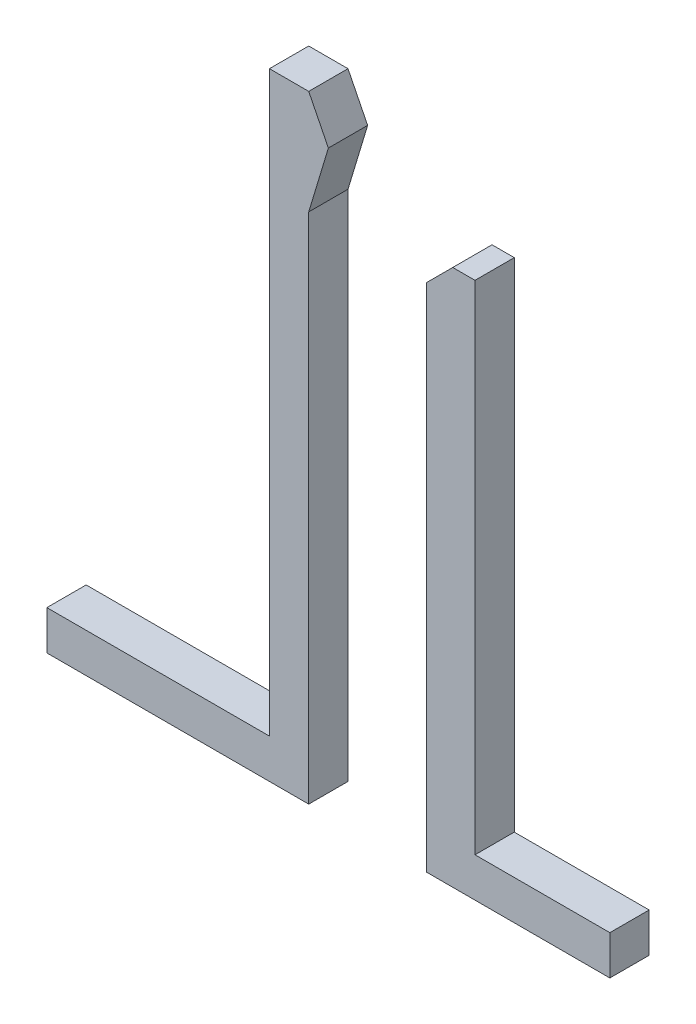
ISO-10303-21;
HEADER;
FILE_DESCRIPTION(('STEP AP214'),'2;1');
FILE_NAME('part.step','',(''),(''),'','','');
FILE_SCHEMA(('AUTOMOTIVE_DESIGN { 1 0 10303 214 1 1 1 1 }'));
ENDSEC;
DATA;
#1=APPLICATION_CONTEXT('core data for automotive mechanical design processes');
#2=APPLICATION_PROTOCOL_DEFINITION('international standard','automotive_design',2000,#1);
#3=PRODUCT_CONTEXT('',#1,'mechanical');
#4=PRODUCT('Part','Part','',(#3));
#5=PRODUCT_RELATED_PRODUCT_CATEGORY('part','',(#4));
#6=PRODUCT_DEFINITION_FORMATION('','',#4);
#7=PRODUCT_DEFINITION_CONTEXT('part definition',#1,'design');
#8=PRODUCT_DEFINITION('design','',#6,#7);
#9=PRODUCT_DEFINITION_SHAPE('','',#8);
#10=(LENGTH_UNIT() NAMED_UNIT(*) SI_UNIT(.MILLI.,.METRE.));
#11=(NAMED_UNIT(*) PLANE_ANGLE_UNIT() SI_UNIT($,.RADIAN.));
#12=(NAMED_UNIT(*) SI_UNIT($,.STERADIAN.) SOLID_ANGLE_UNIT());
#13=UNCERTAINTY_MEASURE_WITH_UNIT(LENGTH_MEASURE(1.E-05),#10,'distance_accuracy_value','');
#14=(GEOMETRIC_REPRESENTATION_CONTEXT(3) GLOBAL_UNCERTAINTY_ASSIGNED_CONTEXT((#13)) GLOBAL_UNIT_ASSIGNED_CONTEXT((#10,
#11,#12)) REPRESENTATION_CONTEXT('',''));
#15=CARTESIAN_POINT('',(0.,0.,0.));
#16=DIRECTION('',(0.,0.,1.));
#17=DIRECTION('',(1.,0.,0.));
#18=AXIS2_PLACEMENT_3D('',#15,#16,#17);
#19=CARTESIAN_POINT('',(1.95,0.2,0.3));
#20=DIRECTION('',(-1.,0.,0.));
#21=DIRECTION('',(0.,0.,1.));
#22=AXIS2_PLACEMENT_3D('',#19,#20,#21);
#23=PLANE('',#22);
#24=DIRECTION('',(0.,1.,0.));
#25=VECTOR('',#24,1.);
#26=CARTESIAN_POINT('',(1.95,0.2,0.));
#27=LINE('',#26,#25);
#28=CARTESIAN_POINT('',(1.95,-0.1,0.));
#29=VERTEX_POINT('',#28);
#30=CARTESIAN_POINT('',(1.95,0.2,0.));
#31=VERTEX_POINT('',#30);
#32=EDGE_CURVE('E135',#29,#31,#27,.T.);
#33=ORIENTED_EDGE('',*,*,#32,.T.);
#34=DIRECTION('',(0.,0.,-1.));
#35=VECTOR('',#34,1.);
#36=CARTESIAN_POINT('',(1.95,0.2,0.3));
#37=LINE('',#36,#35);
#38=CARTESIAN_POINT('',(1.95,0.2,0.3));
#39=VERTEX_POINT('',#38);
#40=EDGE_CURVE('E12',#39,#31,#37,.T.);
#41=ORIENTED_EDGE('',*,*,#40,.F.);
#42=DIRECTION('',(0.,1.,0.));
#43=VECTOR('',#42,1.);
#44=CARTESIAN_POINT('',(1.95,0.2,0.3));
#45=LINE('',#44,#43);
#46=CARTESIAN_POINT('',(1.95,-0.1,0.3));
#47=VERTEX_POINT('',#46);
#48=EDGE_CURVE('E147',#47,#39,#45,.T.);
#49=ORIENTED_EDGE('',*,*,#48,.F.);
#50=DIRECTION('',(0.,0.,-1.));
#51=VECTOR('',#50,1.);
#52=CARTESIAN_POINT('',(1.95,-0.1,0.3));
#53=LINE('',#52,#51);
#54=EDGE_CURVE('E131',#47,#29,#53,.T.);
#55=ORIENTED_EDGE('',*,*,#54,.T.);
#56=EDGE_LOOP('',(#33,#41,#49,#55));
#57=FACE_BOUND('',#56,.T.);
#58=ADVANCED_FACE('F45',(#57),#23,.F.);
#59=CARTESIAN_POINT('',(0.92,0.2,0.3));
#60=DIRECTION('',(0.,-1.,0.));
#61=DIRECTION('',(0.,0.,-1.));
#62=AXIS2_PLACEMENT_3D('',#59,#60,#61);
#63=PLANE('',#62);
#64=DIRECTION('',(-1.,0.,0.));
#65=VECTOR('',#64,1.);
#66=CARTESIAN_POINT('',(0.92,0.2,0.));
#67=LINE('',#66,#65);
#68=CARTESIAN_POINT('',(0.92,0.2,0.));
#69=VERTEX_POINT('',#68);
#70=EDGE_CURVE('E138',#31,#69,#67,.T.);
#71=ORIENTED_EDGE('',*,*,#70,.T.);
#72=DIRECTION('',(0.,0.,-1.));
#73=VECTOR('',#72,1.);
#74=CARTESIAN_POINT('',(0.92,0.2,0.3));
#75=LINE('',#74,#73);
#76=CARTESIAN_POINT('',(0.92,0.2,0.3));
#77=VERTEX_POINT('',#76);
#78=EDGE_CURVE('E53',#77,#69,#75,.T.);
#79=ORIENTED_EDGE('',*,*,#78,.F.);
#80=DIRECTION('',(-1.,0.,0.));
#81=VECTOR('',#80,1.);
#82=CARTESIAN_POINT('',(0.92,0.2,0.3));
#83=LINE('',#82,#81);
#84=EDGE_CURVE('E101',#39,#77,#83,.T.);
#85=ORIENTED_EDGE('',*,*,#84,.F.);
#86=ORIENTED_EDGE('',*,*,#40,.T.);
#87=EDGE_LOOP('',(#71,#79,#85,#86));
#88=FACE_BOUND('',#87,.T.);
#89=ADVANCED_FACE('F172',(#88),#63,.F.);
#90=CARTESIAN_POINT('',(0.92,4.,0.3));
#91=DIRECTION('',(-1.,0.,0.));
#92=DIRECTION('',(0.,-1.,0.));
#93=AXIS2_PLACEMENT_3D('',#90,#91,#92);
#94=PLANE('',#93);
#95=DIRECTION('',(0.,1.,0.));
#96=VECTOR('',#95,1.);
#97=CARTESIAN_POINT('',(0.92,4.,0.));
#98=LINE('',#97,#96);
#99=CARTESIAN_POINT('',(0.92,4.,0.));
#100=VERTEX_POINT('',#99);
#101=EDGE_CURVE('E140',#69,#100,#98,.T.);
#102=ORIENTED_EDGE('',*,*,#101,.T.);
#103=DIRECTION('',(0.,0.,-1.));
#104=VECTOR('',#103,1.);
#105=CARTESIAN_POINT('',(0.92,4.,0.3));
#106=LINE('',#105,#104);
#107=CARTESIAN_POINT('',(0.92,4.,0.3));
#108=VERTEX_POINT('',#107);
#109=EDGE_CURVE('E151',#108,#100,#106,.T.);
#110=ORIENTED_EDGE('',*,*,#109,.F.);
#111=DIRECTION('',(0.,1.,0.));
#112=VECTOR('',#111,1.);
#113=CARTESIAN_POINT('',(0.92,4.,0.3));
#114=LINE('',#113,#112);
#115=EDGE_CURVE('E159',#77,#108,#114,.T.);
#116=ORIENTED_EDGE('',*,*,#115,.F.);
#117=ORIENTED_EDGE('',*,*,#78,.T.);
#118=EDGE_LOOP('',(#102,#110,#116,#117));
#119=FACE_BOUND('',#118,.T.);
#120=ADVANCED_FACE('F157',(#119),#94,.F.);
#121=CARTESIAN_POINT('',(0.75,4.,0.3));
#122=DIRECTION('',(0.,-1.,0.));
#123=DIRECTION('',(0.,0.,-1.));
#124=AXIS2_PLACEMENT_3D('',#121,#122,#123);
#125=PLANE('',#124);
#126=DIRECTION('',(-1.,0.,0.));
#127=VECTOR('',#126,1.);
#128=CARTESIAN_POINT('',(0.75,4.,0.));
#129=LINE('',#128,#127);
#130=CARTESIAN_POINT('',(0.75,4.,0.));
#131=VERTEX_POINT('',#130);
#132=EDGE_CURVE('E142',#100,#131,#129,.T.);
#133=ORIENTED_EDGE('',*,*,#132,.T.);
#134=DIRECTION('',(0.,0.,-1.));
#135=VECTOR('',#134,1.);
#136=CARTESIAN_POINT('',(0.75,4.,0.3));
#137=LINE('',#136,#135);
#138=CARTESIAN_POINT('',(0.75,4.,0.3));
#139=VERTEX_POINT('',#138);
#140=EDGE_CURVE('E126',#139,#131,#137,.T.);
#141=ORIENTED_EDGE('',*,*,#140,.F.);
#142=DIRECTION('',(-1.,0.,0.));
#143=VECTOR('',#142,1.);
#144=CARTESIAN_POINT('',(0.75,4.,0.3));
#145=LINE('',#144,#143);
#146=EDGE_CURVE('E117',#108,#139,#145,.T.);
#147=ORIENTED_EDGE('',*,*,#146,.F.);
#148=ORIENTED_EDGE('',*,*,#109,.T.);
#149=EDGE_LOOP('',(#133,#141,#147,#148));
#150=FACE_BOUND('',#149,.T.);
#151=ADVANCED_FACE('F165',(#150),#125,.F.);
#152=CARTESIAN_POINT('',(0.55,3.8,0.3));
#153=DIRECTION('',(0.707106781186548,-0.707106781186547,0.));
#154=DIRECTION('',(0.707106781186547,0.707106781186548,0.));
#155=AXIS2_PLACEMENT_3D('',#152,#153,#154);
#156=PLANE('',#155);
#157=DIRECTION('',(-0.707106781186547,-0.707106781186548,0.));
#158=VECTOR('',#157,1.);
#159=CARTESIAN_POINT('',(0.55,3.8,0.));
#160=LINE('',#159,#158);
#161=CARTESIAN_POINT('',(0.55,3.8,0.));
#162=VERTEX_POINT('',#161);
#163=EDGE_CURVE('E125',#131,#162,#160,.T.);
#164=ORIENTED_EDGE('',*,*,#163,.T.);
#165=DIRECTION('',(0.,0.,-1.));
#166=VECTOR('',#165,1.);
#167=CARTESIAN_POINT('',(0.55,3.8,0.3));
#168=LINE('',#167,#166);
#169=CARTESIAN_POINT('',(0.55,3.8,0.3));
#170=VERTEX_POINT('',#169);
#171=EDGE_CURVE('E122',#170,#162,#168,.T.);
#172=ORIENTED_EDGE('',*,*,#171,.F.);
#173=DIRECTION('',(-0.707106781186547,-0.707106781186548,0.));
#174=VECTOR('',#173,1.);
#175=CARTESIAN_POINT('',(0.55,3.8,0.3));
#176=LINE('',#175,#174);
#177=EDGE_CURVE('E111',#139,#170,#176,.T.);
#178=ORIENTED_EDGE('',*,*,#177,.F.);
#179=ORIENTED_EDGE('',*,*,#140,.T.);
#180=EDGE_LOOP('',(#164,#172,#178,#179));
#181=FACE_BOUND('',#180,.T.);
#182=ADVANCED_FACE('F123',(#181),#156,.F.);
#183=CARTESIAN_POINT('',(0.55,-0.1,0.3));
#184=DIRECTION('',(1.,0.,0.));
#185=DIRECTION('',(0.,0.,-1.));
#186=AXIS2_PLACEMENT_3D('',#183,#184,#185);
#187=PLANE('',#186);
#188=DIRECTION('',(0.,-1.,0.));
#189=VECTOR('',#188,1.);
#190=CARTESIAN_POINT('',(0.55,-0.1,0.));
#191=LINE('',#190,#189);
#192=CARTESIAN_POINT('',(0.55,-0.1,0.));
#193=VERTEX_POINT('',#192);
#194=EDGE_CURVE('E87',#162,#193,#191,.T.);
#195=ORIENTED_EDGE('',*,*,#194,.T.);
#196=DIRECTION('',(0.,0.,-1.));
#197=VECTOR('',#196,1.);
#198=CARTESIAN_POINT('',(0.55,-0.1,0.3));
#199=LINE('',#198,#197);
#200=CARTESIAN_POINT('',(0.55,-0.1,0.3));
#201=VERTEX_POINT('',#200);
#202=EDGE_CURVE('E127',#201,#193,#199,.T.);
#203=ORIENTED_EDGE('',*,*,#202,.F.);
#204=DIRECTION('',(0.,-1.,0.));
#205=VECTOR('',#204,1.);
#206=CARTESIAN_POINT('',(0.55,-0.1,0.3));
#207=LINE('',#206,#205);
#208=EDGE_CURVE('E115',#170,#201,#207,.T.);
#209=ORIENTED_EDGE('',*,*,#208,.F.);
#210=ORIENTED_EDGE('',*,*,#171,.T.);
#211=EDGE_LOOP('',(#195,#203,#209,#210));
#212=FACE_BOUND('',#211,.T.);
#213=ADVANCED_FACE('F129',(#212),#187,.F.);
#214=CARTESIAN_POINT('',(1.95,-0.1,0.3));
#215=DIRECTION('',(0.,1.,0.));
#216=DIRECTION('',(-1.,0.,0.));
#217=AXIS2_PLACEMENT_3D('',#214,#215,#216);
#218=PLANE('',#217);
#219=DIRECTION('',(1.,0.,0.));
#220=VECTOR('',#219,1.);
#221=CARTESIAN_POINT('',(1.95,-0.1,0.));
#222=LINE('',#221,#220);
#223=EDGE_CURVE('E93',#193,#29,#222,.T.);
#224=ORIENTED_EDGE('',*,*,#223,.T.);
#225=ORIENTED_EDGE('',*,*,#54,.F.);
#226=DIRECTION('',(1.,0.,0.));
#227=VECTOR('',#226,1.);
#228=CARTESIAN_POINT('',(1.95,-0.1,0.3));
#229=LINE('',#228,#227);
#230=EDGE_CURVE('E61',#201,#47,#229,.T.);
#231=ORIENTED_EDGE('',*,*,#230,.F.);
#232=ORIENTED_EDGE('',*,*,#202,.T.);
#233=EDGE_LOOP('',(#224,#225,#231,#232));
#234=FACE_BOUND('',#233,.T.);
#235=ADVANCED_FACE('F186',(#234),#218,.F.);
#236=CARTESIAN_POINT('',(0.,0.,0.3));
#237=DIRECTION('',(0.,0.,-1.));
#238=DIRECTION('',(-1.,0.,0.));
#239=AXIS2_PLACEMENT_3D('',#236,#237,#238);
#240=PLANE('',#239);
#241=ORIENTED_EDGE('',*,*,#48,.T.);
#242=ORIENTED_EDGE('',*,*,#84,.T.);
#243=ORIENTED_EDGE('',*,*,#115,.T.);
#244=ORIENTED_EDGE('',*,*,#146,.T.);
#245=ORIENTED_EDGE('',*,*,#177,.T.);
#246=ORIENTED_EDGE('',*,*,#208,.T.);
#247=ORIENTED_EDGE('',*,*,#230,.T.);
#248=EDGE_LOOP('',(#241,#242,#243,#244,#245,#246,#247));
#249=FACE_BOUND('',#248,.T.);
#250=ADVANCED_FACE('F113',(#249),#240,.F.);
#251=CARTESIAN_POINT('',(0.,0.,0.));
#252=DIRECTION('',(0.,0.,-1.));
#253=DIRECTION('',(-1.,0.,0.));
#254=AXIS2_PLACEMENT_3D('',#251,#252,#253);
#255=PLANE('',#254);
#256=ORIENTED_EDGE('',*,*,#32,.F.);
#257=ORIENTED_EDGE('',*,*,#223,.F.);
#258=ORIENTED_EDGE('',*,*,#194,.F.);
#259=ORIENTED_EDGE('',*,*,#163,.F.);
#260=ORIENTED_EDGE('',*,*,#132,.F.);
#261=ORIENTED_EDGE('',*,*,#101,.F.);
#262=ORIENTED_EDGE('',*,*,#70,.F.);
#263=EDGE_LOOP('',(#256,#257,#258,#259,#260,#261,#262));
#264=FACE_BOUND('',#263,.T.);
#265=ADVANCED_FACE('F163',(#264),#255,.T.);
#266=CLOSED_SHELL('',(#58,#89,#120,#151,#182,#213,#235,#250,#265));
#267=MANIFOLD_SOLID_BREP('B2',#266);
#268=CARTESIAN_POINT('',(-2.35,0.2,0.3));
#269=DIRECTION('',(1.,0.,0.));
#270=DIRECTION('',(0.,0.,-1.));
#271=AXIS2_PLACEMENT_3D('',#268,#269,#270);
#272=PLANE('',#271);
#273=DIRECTION('',(0.,-1.,0.));
#274=VECTOR('',#273,1.);
#275=CARTESIAN_POINT('',(-2.35,0.2,0.));
#276=LINE('',#275,#274);
#277=CARTESIAN_POINT('',(-2.35,0.2,0.));
#278=VERTEX_POINT('',#277);
#279=CARTESIAN_POINT('',(-2.35,-0.1,0.));
#280=VERTEX_POINT('',#279);
#281=EDGE_CURVE('E343',#278,#280,#276,.T.);
#282=ORIENTED_EDGE('',*,*,#281,.T.);
#283=DIRECTION('',(0.,0.,-1.));
#284=VECTOR('',#283,1.);
#285=CARTESIAN_POINT('',(-2.35,-0.1,0.3));
#286=LINE('',#285,#284);
#287=CARTESIAN_POINT('',(-2.35,-0.1,0.3));
#288=VERTEX_POINT('',#287);
#289=EDGE_CURVE('E43',#288,#280,#286,.T.);
#290=ORIENTED_EDGE('',*,*,#289,.F.);
#291=DIRECTION('',(0.,-1.,0.));
#292=VECTOR('',#291,1.);
#293=CARTESIAN_POINT('',(-2.35,0.2,0.3));
#294=LINE('',#293,#292);
#295=CARTESIAN_POINT('',(-2.35,0.2,0.3));
#296=VERTEX_POINT('',#295);
#297=EDGE_CURVE('E357',#296,#288,#294,.T.);
#298=ORIENTED_EDGE('',*,*,#297,.F.);
#299=DIRECTION('',(0.,0.,-1.));
#300=VECTOR('',#299,1.);
#301=CARTESIAN_POINT('',(-2.35,0.2,0.3));
#302=LINE('',#301,#300);
#303=EDGE_CURVE('E339',#296,#278,#302,.T.);
#304=ORIENTED_EDGE('',*,*,#303,.T.);
#305=EDGE_LOOP('',(#282,#290,#298,#304));
#306=FACE_BOUND('',#305,.T.);
#307=ADVANCED_FACE('F247',(#306),#272,.F.);
#308=CARTESIAN_POINT('',(-2.35,-0.1,0.3));
#309=DIRECTION('',(0.,1.,0.));
#310=DIRECTION('',(0.,0.,1.));
#311=AXIS2_PLACEMENT_3D('',#308,#309,#310);
#312=PLANE('',#311);
#313=DIRECTION('',(1.,0.,0.));
#314=VECTOR('',#313,1.);
#315=CARTESIAN_POINT('',(-2.35,-0.1,0.));
#316=LINE('',#315,#314);
#317=CARTESIAN_POINT('',(-0.35,-0.1,0.));
#318=VERTEX_POINT('',#317);
#319=EDGE_CURVE('E346',#280,#318,#316,.T.);
#320=ORIENTED_EDGE('',*,*,#319,.T.);
#321=DIRECTION('',(0.,0.,-1.));
#322=VECTOR('',#321,1.);
#323=CARTESIAN_POINT('',(-0.35,-0.1,0.3));
#324=LINE('',#323,#322);
#325=CARTESIAN_POINT('',(-0.35,-0.1,0.3));
#326=VERTEX_POINT('',#325);
#327=EDGE_CURVE('E255',#326,#318,#324,.T.);
#328=ORIENTED_EDGE('',*,*,#327,.F.);
#329=DIRECTION('',(1.,0.,0.));
#330=VECTOR('',#329,1.);
#331=CARTESIAN_POINT('',(-2.35,-0.1,0.3));
#332=LINE('',#331,#330);
#333=EDGE_CURVE('E306',#288,#326,#332,.T.);
#334=ORIENTED_EDGE('',*,*,#333,.F.);
#335=ORIENTED_EDGE('',*,*,#289,.T.);
#336=EDGE_LOOP('',(#320,#328,#334,#335));
#337=FACE_BOUND('',#336,.T.);
#338=ADVANCED_FACE('F392',(#337),#312,.F.);
#339=CARTESIAN_POINT('',(-0.35,-0.1,0.3));
#340=DIRECTION('',(-1.,0.,0.));
#341=DIRECTION('',(0.,0.,1.));
#342=AXIS2_PLACEMENT_3D('',#339,#340,#341);
#343=PLANE('',#342);
#344=DIRECTION('',(0.,1.,0.));
#345=VECTOR('',#344,1.);
#346=CARTESIAN_POINT('',(-0.35,-0.1,0.));
#347=LINE('',#346,#345);
#348=CARTESIAN_POINT('',(-0.35,3.81740715259392,0.));
#349=VERTEX_POINT('',#348);
#350=EDGE_CURVE('E348',#318,#349,#347,.T.);
#351=ORIENTED_EDGE('',*,*,#350,.T.);
#352=DIRECTION('',(0.,0.,-1.));
#353=VECTOR('',#352,1.);
#354=CARTESIAN_POINT('',(-0.35,3.81740715259392,0.3));
#355=LINE('',#354,#353);
#356=CARTESIAN_POINT('',(-0.35,3.81740715259392,0.3));
#357=VERTEX_POINT('',#356);
#358=EDGE_CURVE('E364',#357,#349,#355,.T.);
#359=ORIENTED_EDGE('',*,*,#358,.F.);
#360=DIRECTION('',(0.,1.,0.));
#361=VECTOR('',#360,1.);
#362=CARTESIAN_POINT('',(-0.35,-0.1,0.3));
#363=LINE('',#362,#361);
#364=EDGE_CURVE('E372',#326,#357,#363,.T.);
#365=ORIENTED_EDGE('',*,*,#364,.F.);
#366=ORIENTED_EDGE('',*,*,#327,.T.);
#367=EDGE_LOOP('',(#351,#359,#365,#366));
#368=FACE_BOUND('',#367,.T.);
#369=ADVANCED_FACE('F370',(#368),#343,.F.);
#370=CARTESIAN_POINT('',(-0.2,4.31481667929813,0.3));
#371=DIRECTION('',(-0.957413602339711,0.288719923203956,0.));
#372=DIRECTION('',(-0.288719923203956,-0.957413602339711,0.));
#373=AXIS2_PLACEMENT_3D('',#370,#371,#372);
#374=PLANE('',#373);
#375=DIRECTION('',(0.288719923203956,0.957413602339711,0.));
#376=VECTOR('',#375,1.);
#377=CARTESIAN_POINT('',(-0.2,4.31481667929813,0.));
#378=LINE('',#377,#376);
#379=CARTESIAN_POINT('',(-0.2,4.31481667929813,0.));
#380=VERTEX_POINT('',#379);
#381=EDGE_CURVE('E350',#349,#380,#378,.T.);
#382=ORIENTED_EDGE('',*,*,#381,.T.);
#383=DIRECTION('',(0.,0.,-1.));
#384=VECTOR('',#383,1.);
#385=CARTESIAN_POINT('',(-0.2,4.31481667929813,0.3));
#386=LINE('',#385,#384);
#387=CARTESIAN_POINT('',(-0.2,4.31481667929813,0.3));
#388=VERTEX_POINT('',#387);
#389=EDGE_CURVE('E361',#388,#380,#386,.T.);
#390=ORIENTED_EDGE('',*,*,#389,.F.);
#391=DIRECTION('',(0.288719923203956,0.957413602339711,0.));
#392=VECTOR('',#391,1.);
#393=CARTESIAN_POINT('',(-0.2,4.31481667929813,0.3));
#394=LINE('',#393,#392);
#395=EDGE_CURVE('E384',#357,#388,#394,.T.);
#396=ORIENTED_EDGE('',*,*,#395,.F.);
#397=ORIENTED_EDGE('',*,*,#358,.T.);
#398=EDGE_LOOP('',(#382,#390,#396,#397));
#399=FACE_BOUND('',#398,.T.);
#400=ADVANCED_FACE('F380',(#399),#374,.F.);
#401=CARTESIAN_POINT('',(-0.35,4.61481667929813,0.3));
#402=DIRECTION('',(-0.894427190999916,-0.447213595499958,0.));
#403=DIRECTION('',(0.447213595499958,-0.894427190999916,0.));
#404=AXIS2_PLACEMENT_3D('',#401,#402,#403);
#405=PLANE('',#404);
#406=DIRECTION('',(-0.447213595499958,0.894427190999916,0.));
#407=VECTOR('',#406,1.);
#408=CARTESIAN_POINT('',(-0.35,4.61481667929813,0.));
#409=LINE('',#408,#407);
#410=CARTESIAN_POINT('',(-0.35,4.61481667929813,0.));
#411=VERTEX_POINT('',#410);
#412=EDGE_CURVE('E352',#380,#411,#409,.T.);
#413=ORIENTED_EDGE('',*,*,#412,.T.);
#414=DIRECTION('',(0.,0.,-1.));
#415=VECTOR('',#414,1.);
#416=CARTESIAN_POINT('',(-0.35,4.61481667929813,0.3));
#417=LINE('',#416,#415);
#418=CARTESIAN_POINT('',(-0.35,4.61481667929813,0.3));
#419=VERTEX_POINT('',#418);
#420=EDGE_CURVE('E334',#419,#411,#417,.T.);
#421=ORIENTED_EDGE('',*,*,#420,.F.);
#422=DIRECTION('',(-0.447213595499958,0.894427190999916,0.));
#423=VECTOR('',#422,1.);
#424=CARTESIAN_POINT('',(-0.35,4.61481667929813,0.3));
#425=LINE('',#424,#423);
#426=EDGE_CURVE('E325',#388,#419,#425,.T.);
#427=ORIENTED_EDGE('',*,*,#426,.F.);
#428=ORIENTED_EDGE('',*,*,#389,.T.);
#429=EDGE_LOOP('',(#413,#421,#427,#428));
#430=FACE_BOUND('',#429,.T.);
#431=ADVANCED_FACE('F383',(#430),#405,.F.);
#432=CARTESIAN_POINT('',(-0.35,4.61481667929813,0.3));
#433=DIRECTION('',(0.,-1.,0.));
#434=DIRECTION('',(0.,0.,-1.));
#435=AXIS2_PLACEMENT_3D('',#432,#433,#434);
#436=PLANE('',#435);
#437=DIRECTION('',(-1.,0.,0.));
#438=VECTOR('',#437,1.);
#439=CARTESIAN_POINT('',(-0.35,4.61481667929813,0.));
#440=LINE('',#439,#438);
#441=CARTESIAN_POINT('',(-0.65,4.61481667929813,0.));
#442=VERTEX_POINT('',#441);
#443=EDGE_CURVE('E333',#411,#442,#440,.T.);
#444=ORIENTED_EDGE('',*,*,#443,.T.);
#445=DIRECTION('',(0.,0.,-1.));
#446=VECTOR('',#445,1.);
#447=CARTESIAN_POINT('',(-0.65,4.61481667929813,0.3));
#448=LINE('',#447,#446);
#449=CARTESIAN_POINT('',(-0.65,4.61481667929813,0.3));
#450=VERTEX_POINT('',#449);
#451=EDGE_CURVE('E330',#450,#442,#448,.T.);
#452=ORIENTED_EDGE('',*,*,#451,.F.);
#453=DIRECTION('',(-1.,0.,0.));
#454=VECTOR('',#453,1.);
#455=CARTESIAN_POINT('',(-0.35,4.61481667929813,0.3));
#456=LINE('',#455,#454);
#457=EDGE_CURVE('E319',#419,#450,#456,.T.);
#458=ORIENTED_EDGE('',*,*,#457,.F.);
#459=ORIENTED_EDGE('',*,*,#420,.T.);
#460=EDGE_LOOP('',(#444,#452,#458,#459));
#461=FACE_BOUND('',#460,.T.);
#462=ADVANCED_FACE('F331',(#461),#436,.F.);
#463=CARTESIAN_POINT('',(-0.65,4.61481667929813,0.3));
#464=DIRECTION('',(1.,0.,0.));
#465=DIRECTION('',(0.,1.,0.));
#466=AXIS2_PLACEMENT_3D('',#463,#464,#465);
#467=PLANE('',#466);
#468=DIRECTION('',(0.,-1.,0.));
#469=VECTOR('',#468,1.);
#470=CARTESIAN_POINT('',(-0.65,4.61481667929813,0.));
#471=LINE('',#470,#469);
#472=CARTESIAN_POINT('',(-0.65,0.2,0.));
#473=VERTEX_POINT('',#472);
#474=EDGE_CURVE('E292',#442,#473,#471,.T.);
#475=ORIENTED_EDGE('',*,*,#474,.T.);
#476=DIRECTION('',(0.,0.,-1.));
#477=VECTOR('',#476,1.);
#478=CARTESIAN_POINT('',(-0.65,0.2,0.3));
#479=LINE('',#478,#477);
#480=CARTESIAN_POINT('',(-0.65,0.2,0.3));
#481=VERTEX_POINT('',#480);
#482=EDGE_CURVE('E335',#481,#473,#479,.T.);
#483=ORIENTED_EDGE('',*,*,#482,.F.);
#484=DIRECTION('',(0.,-1.,0.));
#485=VECTOR('',#484,1.);
#486=CARTESIAN_POINT('',(-0.65,4.61481667929813,0.3));
#487=LINE('',#486,#485);
#488=EDGE_CURVE('E323',#450,#481,#487,.T.);
#489=ORIENTED_EDGE('',*,*,#488,.F.);
#490=ORIENTED_EDGE('',*,*,#451,.T.);
#491=EDGE_LOOP('',(#475,#483,#489,#490));
#492=FACE_BOUND('',#491,.T.);
#493=ADVANCED_FACE('F337',(#492),#467,.F.);
#494=CARTESIAN_POINT('',(-0.65,0.2,0.3));
#495=DIRECTION('',(0.,-1.,0.));
#496=DIRECTION('',(1.,0.,0.));
#497=AXIS2_PLACEMENT_3D('',#494,#495,#496);
#498=PLANE('',#497);
#499=DIRECTION('',(-1.,0.,0.));
#500=VECTOR('',#499,1.);
#501=CARTESIAN_POINT('',(-0.65,0.2,0.));
#502=LINE('',#501,#500);
#503=EDGE_CURVE('E298',#473,#278,#502,.T.);
#504=ORIENTED_EDGE('',*,*,#503,.T.);
#505=ORIENTED_EDGE('',*,*,#303,.F.);
#506=DIRECTION('',(-1.,0.,0.));
#507=VECTOR('',#506,1.);
#508=CARTESIAN_POINT('',(-0.65,0.2,0.3));
#509=LINE('',#508,#507);
#510=EDGE_CURVE('E263',#481,#296,#509,.T.);
#511=ORIENTED_EDGE('',*,*,#510,.F.);
#512=ORIENTED_EDGE('',*,*,#482,.T.);
#513=EDGE_LOOP('',(#504,#505,#511,#512));
#514=FACE_BOUND('',#513,.T.);
#515=ADVANCED_FACE('F408',(#514),#498,.F.);
#516=CARTESIAN_POINT('',(0.,0.,0.3));
#517=DIRECTION('',(0.,0.,1.));
#518=DIRECTION('',(1.,0.,0.));
#519=AXIS2_PLACEMENT_3D('',#516,#517,#518);
#520=PLANE('',#519);
#521=ORIENTED_EDGE('',*,*,#297,.T.);
#522=ORIENTED_EDGE('',*,*,#333,.T.);
#523=ORIENTED_EDGE('',*,*,#364,.T.);
#524=ORIENTED_EDGE('',*,*,#395,.T.);
#525=ORIENTED_EDGE('',*,*,#426,.T.);
#526=ORIENTED_EDGE('',*,*,#457,.T.);
#527=ORIENTED_EDGE('',*,*,#488,.T.);
#528=ORIENTED_EDGE('',*,*,#510,.T.);
#529=EDGE_LOOP('',(#521,#522,#523,#524,#525,#526,#527,#528));
#530=FACE_BOUND('',#529,.T.);
#531=ADVANCED_FACE('F321',(#530),#520,.T.);
#532=CARTESIAN_POINT('',(0.,0.,0.));
#533=DIRECTION('',(0.,0.,1.));
#534=DIRECTION('',(1.,0.,0.));
#535=AXIS2_PLACEMENT_3D('',#532,#533,#534);
#536=PLANE('',#535);
#537=ORIENTED_EDGE('',*,*,#281,.F.);
#538=ORIENTED_EDGE('',*,*,#503,.F.);
#539=ORIENTED_EDGE('',*,*,#474,.F.);
#540=ORIENTED_EDGE('',*,*,#443,.F.);
#541=ORIENTED_EDGE('',*,*,#412,.F.);
#542=ORIENTED_EDGE('',*,*,#381,.F.);
#543=ORIENTED_EDGE('',*,*,#350,.F.);
#544=ORIENTED_EDGE('',*,*,#319,.F.);
#545=EDGE_LOOP('',(#537,#538,#539,#540,#541,#542,#543,#544));
#546=FACE_BOUND('',#545,.T.);
#547=ADVANCED_FACE('F376',(#546),#536,.F.);
#548=CLOSED_SHELL('',(#307,#338,#369,#400,#431,#462,#493,#515,#531,#547));
#549=MANIFOLD_SOLID_BREP('B6',#548);
#550=ADVANCED_BREP_SHAPE_REPRESENTATION('',(#18,#267,#549),#14);
#551=SHAPE_DEFINITION_REPRESENTATION(#9,#550);
ENDSEC;
END-ISO-10303-21;
